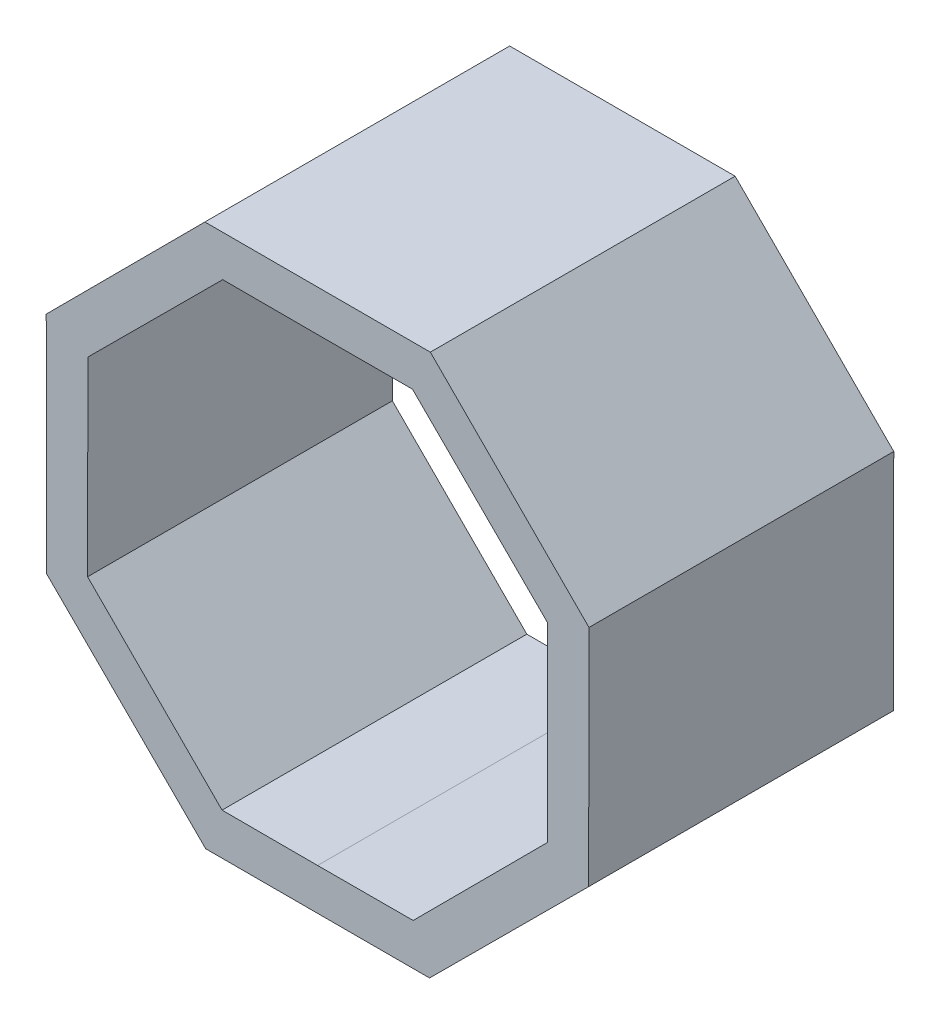
ISO-10303-21;
HEADER;
FILE_DESCRIPTION(('STEP AP214'),'2;1');
FILE_NAME('part.step','',(''),(''),'','','');
FILE_SCHEMA(('AUTOMOTIVE_DESIGN { 1 0 10303 214 1 1 1 1 }'));
ENDSEC;
DATA;
#1=APPLICATION_CONTEXT('core data for automotive mechanical design processes');
#2=APPLICATION_PROTOCOL_DEFINITION('international standard','automotive_design',2000,#1);
#3=PRODUCT_CONTEXT('',#1,'mechanical');
#4=PRODUCT('Part','Part','',(#3));
#5=PRODUCT_RELATED_PRODUCT_CATEGORY('part','',(#4));
#6=PRODUCT_DEFINITION_FORMATION('','',#4);
#7=PRODUCT_DEFINITION_CONTEXT('part definition',#1,'design');
#8=PRODUCT_DEFINITION('design','',#6,#7);
#9=PRODUCT_DEFINITION_SHAPE('','',#8);
#10=(LENGTH_UNIT() NAMED_UNIT(*) SI_UNIT(.MILLI.,.METRE.));
#11=(NAMED_UNIT(*) PLANE_ANGLE_UNIT() SI_UNIT($,.RADIAN.));
#12=(NAMED_UNIT(*) SI_UNIT($,.STERADIAN.) SOLID_ANGLE_UNIT());
#13=UNCERTAINTY_MEASURE_WITH_UNIT(LENGTH_MEASURE(1.E-05),#10,'distance_accuracy_value','');
#14=(GEOMETRIC_REPRESENTATION_CONTEXT(3) GLOBAL_UNCERTAINTY_ASSIGNED_CONTEXT((#13)) GLOBAL_UNIT_ASSIGNED_CONTEXT((#10,
#11,#12)) REPRESENTATION_CONTEXT('',''));
#15=CARTESIAN_POINT('',(0.,0.,0.));
#16=DIRECTION('',(0.,0.,1.));
#17=DIRECTION('',(1.,0.,0.));
#18=AXIS2_PLACEMENT_3D('',#15,#16,#17);
#19=CARTESIAN_POINT('',(-4.36451658606529,10.4936603456736,1.2));
#20=DIRECTION('',(-0.708135002050255,0.706077062983415,0.));
#21=DIRECTION('',(-0.706077062983415,-0.708135002050255,0.));
#22=AXIS2_PLACEMENT_3D('',#19,#20,#21);
#23=PLANE('',#22);
#24=DIRECTION('',(0.,0.,1.));
#25=VECTOR('',#24,1.);
#26=CARTESIAN_POINT('',(-4.36451658606529,10.4936603456736,1.2));
#27=LINE('',#26,#25);
#28=CARTESIAN_POINT('',(-4.36451658606529,10.4936603456736,-0.800000000000002));
#29=VERTEX_POINT('',#28);
#30=CARTESIAN_POINT('',(-4.36451658606529,10.4936603456736,11.));
#31=VERTEX_POINT('',#30);
#32=EDGE_CURVE('E11',#29,#31,#27,.T.);
#33=ORIENTED_EDGE('',*,*,#32,.F.);
#34=DIRECTION('',(-0.706077062983415,-0.708135002050255,0.));
#35=VECTOR('',#34,1.);
#36=CARTESIAN_POINT('',(-10.5063170194626,4.33395896106958,-0.800000000000002));
#37=LINE('',#36,#35);
#38=CARTESIAN_POINT('',(-10.5063170194626,4.33395896106958,-0.800000000000002));
#39=VERTEX_POINT('',#38);
#40=EDGE_CURVE('E201',#29,#39,#37,.T.);
#41=ORIENTED_EDGE('',*,*,#40,.T.);
#42=DIRECTION('',(0.,0.,1.));
#43=VECTOR('',#42,1.);
#44=CARTESIAN_POINT('',(-10.5063170194626,4.33395896106958,1.2));
#45=LINE('',#44,#43);
#46=CARTESIAN_POINT('',(-10.5063170194626,4.33395896106958,11.));
#47=VERTEX_POINT('',#46);
#48=EDGE_CURVE('E42',#39,#47,#45,.T.);
#49=ORIENTED_EDGE('',*,*,#48,.T.);
#50=DIRECTION('',(-0.706077062983415,-0.708135002050255,0.));
#51=VECTOR('',#50,1.);
#52=CARTESIAN_POINT('',(-4.36451658606529,10.4936603456736,11.));
#53=LINE('',#52,#51);
#54=EDGE_CURVE('E263',#31,#47,#53,.T.);
#55=ORIENTED_EDGE('',*,*,#54,.F.);
#56=EDGE_LOOP('',(#33,#41,#49,#55));
#57=FACE_BOUND('',#56,.T.);
#58=ADVANCED_FACE('F39',(#57),#23,.T.);
#59=CARTESIAN_POINT('',(-4.36451658606529,10.4936603456736,1.2));
#60=DIRECTION('',(0.,1.,0.));
#61=DIRECTION('',(0.,0.,1.));
#62=AXIS2_PLACEMENT_3D('',#59,#60,#61);
#63=PLANE('',#62);
#64=DIRECTION('',(0.,0.,1.));
#65=VECTOR('',#64,1.);
#66=CARTESIAN_POINT('',(4.36451658606529,10.4936603456736,1.2));
#67=LINE('',#66,#65);
#68=CARTESIAN_POINT('',(4.36451658606529,10.4936603456736,-0.800000000000002));
#69=VERTEX_POINT('',#68);
#70=CARTESIAN_POINT('',(4.36451658606529,10.4936603456736,11.));
#71=VERTEX_POINT('',#70);
#72=EDGE_CURVE('E47',#69,#71,#67,.T.);
#73=ORIENTED_EDGE('',*,*,#72,.F.);
#74=DIRECTION('',(-1.,0.,0.));
#75=VECTOR('',#74,1.);
#76=CARTESIAN_POINT('',(-4.36451658606529,10.4936603456736,-0.800000000000002));
#77=LINE('',#76,#75);
#78=EDGE_CURVE('E184',#69,#29,#77,.T.);
#79=ORIENTED_EDGE('',*,*,#78,.T.);
#80=ORIENTED_EDGE('',*,*,#32,.T.);
#81=DIRECTION('',(-1.,0.,0.));
#82=VECTOR('',#81,1.);
#83=CARTESIAN_POINT('',(-4.36451658606529,10.4936603456736,11.));
#84=LINE('',#83,#82);
#85=EDGE_CURVE('E298',#71,#31,#84,.T.);
#86=ORIENTED_EDGE('',*,*,#85,.F.);
#87=EDGE_LOOP('',(#73,#79,#80,#86));
#88=FACE_BOUND('',#87,.T.);
#89=ADVANCED_FACE('F315',(#88),#63,.T.);
#90=CARTESIAN_POINT('',(4.36451658606529,10.4936603456736,1.2));
#91=DIRECTION('',(0.708135002050255,0.706077062983415,0.));
#92=DIRECTION('',(-0.706077062983415,0.708135002050255,0.));
#93=AXIS2_PLACEMENT_3D('',#90,#91,#92);
#94=PLANE('',#93);
#95=DIRECTION('',(0.,0.,1.));
#96=VECTOR('',#95,1.);
#97=CARTESIAN_POINT('',(10.5063170194626,4.33395896106958,1.2));
#98=LINE('',#97,#96);
#99=CARTESIAN_POINT('',(10.5063170194626,4.33395896106958,-0.800000000000002));
#100=VERTEX_POINT('',#99);
#101=CARTESIAN_POINT('',(10.5063170194626,4.33395896106958,11.));
#102=VERTEX_POINT('',#101);
#103=EDGE_CURVE('E164',#100,#102,#98,.T.);
#104=ORIENTED_EDGE('',*,*,#103,.F.);
#105=DIRECTION('',(-0.706077062983415,0.708135002050255,0.));
#106=VECTOR('',#105,1.);
#107=CARTESIAN_POINT('',(4.36451658606529,10.4936603456736,-0.800000000000002));
#108=LINE('',#107,#106);
#109=EDGE_CURVE('E167',#100,#69,#108,.T.);
#110=ORIENTED_EDGE('',*,*,#109,.T.);
#111=ORIENTED_EDGE('',*,*,#72,.T.);
#112=DIRECTION('',(-0.706077062983415,0.708135002050255,0.));
#113=VECTOR('',#112,1.);
#114=CARTESIAN_POINT('',(4.36451658606529,10.4936603456736,11.));
#115=LINE('',#114,#113);
#116=EDGE_CURVE('E169',#102,#71,#115,.T.);
#117=ORIENTED_EDGE('',*,*,#116,.F.);
#118=EDGE_LOOP('',(#104,#110,#111,#117));
#119=FACE_BOUND('',#118,.T.);
#120=ADVANCED_FACE('F166',(#119),#94,.T.);
#121=CARTESIAN_POINT('',(10.4936603456736,-4.36451658606529,1.2));
#122=DIRECTION('',(0.999998941423632,-0.0014550435099099,0.));
#123=DIRECTION('',(0.0014550435099099,0.999998941423632,0.));
#124=AXIS2_PLACEMENT_3D('',#121,#122,#123);
#125=PLANE('',#124);
#126=DIRECTION('',(0.0014550435099099,0.999998941423632,0.));
#127=VECTOR('',#126,1.);
#128=CARTESIAN_POINT('',(10.4936603456736,-4.36451658606529,11.));
#129=LINE('',#128,#127);
#130=CARTESIAN_POINT('',(10.4936603456736,-4.36451658606529,11.));
#131=VERTEX_POINT('',#130);
#132=EDGE_CURVE('E295',#131,#102,#129,.T.);
#133=ORIENTED_EDGE('',*,*,#132,.F.);
#134=DIRECTION('',(0.,0.,1.));
#135=VECTOR('',#134,1.);
#136=CARTESIAN_POINT('',(10.4936603456736,-4.36451658606529,1.2));
#137=LINE('',#136,#135);
#138=CARTESIAN_POINT('',(10.4936603456736,-4.36451658606529,-0.800000000000002));
#139=VERTEX_POINT('',#138);
#140=EDGE_CURVE('E174',#139,#131,#137,.T.);
#141=ORIENTED_EDGE('',*,*,#140,.F.);
#142=DIRECTION('',(0.0014550435099099,0.999998941423632,0.));
#143=VECTOR('',#142,1.);
#144=CARTESIAN_POINT('',(10.5063170194626,4.33395896106958,-0.800000000000002));
#145=LINE('',#144,#143);
#146=EDGE_CURVE('E181',#139,#100,#145,.T.);
#147=ORIENTED_EDGE('',*,*,#146,.T.);
#148=ORIENTED_EDGE('',*,*,#103,.T.);
#149=EDGE_LOOP('',(#133,#141,#147,#148));
#150=FACE_BOUND('',#149,.T.);
#151=ADVANCED_FACE('F186',(#150),#125,.T.);
#152=CARTESIAN_POINT('',(4.33395896106958,-10.5063170194626,1.2));
#153=DIRECTION('',(0.706077062983415,-0.708135002050255,0.));
#154=DIRECTION('',(0.708135002050255,0.706077062983415,0.));
#155=AXIS2_PLACEMENT_3D('',#152,#153,#154);
#156=PLANE('',#155);
#157=DIRECTION('',(0.,0.,1.));
#158=VECTOR('',#157,1.);
#159=CARTESIAN_POINT('',(4.33395896106958,-10.5063170194626,1.2));
#160=LINE('',#159,#158);
#161=CARTESIAN_POINT('',(4.33395896106958,-10.5063170194626,-0.800000000000002));
#162=VERTEX_POINT('',#161);
#163=CARTESIAN_POINT('',(4.33395896106958,-10.5063170194626,11.));
#164=VERTEX_POINT('',#163);
#165=EDGE_CURVE('E303',#162,#164,#160,.T.);
#166=ORIENTED_EDGE('',*,*,#165,.F.);
#167=DIRECTION('',(0.708135002050255,0.706077062983415,0.));
#168=VECTOR('',#167,1.);
#169=CARTESIAN_POINT('',(10.4936603456736,-4.36451658606529,-0.800000000000002));
#170=LINE('',#169,#168);
#171=EDGE_CURVE('E187',#162,#139,#170,.T.);
#172=ORIENTED_EDGE('',*,*,#171,.T.);
#173=ORIENTED_EDGE('',*,*,#140,.T.);
#174=DIRECTION('',(0.708135002050255,0.706077062983415,0.));
#175=VECTOR('',#174,1.);
#176=CARTESIAN_POINT('',(4.33395896106958,-10.5063170194626,11.));
#177=LINE('',#176,#175);
#178=EDGE_CURVE('E292',#164,#131,#177,.T.);
#179=ORIENTED_EDGE('',*,*,#178,.F.);
#180=EDGE_LOOP('',(#166,#172,#173,#179));
#181=FACE_BOUND('',#180,.T.);
#182=ADVANCED_FACE('F380',(#181),#156,.T.);
#183=CARTESIAN_POINT('',(-4.33395896106958,-10.5063170194626,1.2));
#184=DIRECTION('',(0.,-1.,0.));
#185=DIRECTION('',(0.,0.,-1.));
#186=AXIS2_PLACEMENT_3D('',#183,#184,#185);
#187=PLANE('',#186);
#188=DIRECTION('',(0.,0.,1.));
#189=VECTOR('',#188,1.);
#190=CARTESIAN_POINT('',(-4.33395896106958,-10.5063170194626,1.2));
#191=LINE('',#190,#189);
#192=CARTESIAN_POINT('',(-4.33395896106958,-10.5063170194626,-0.800000000000002));
#193=VERTEX_POINT('',#192);
#194=CARTESIAN_POINT('',(-4.33395896106958,-10.5063170194626,11.));
#195=VERTEX_POINT('',#194);
#196=EDGE_CURVE('E305',#193,#195,#191,.T.);
#197=ORIENTED_EDGE('',*,*,#196,.F.);
#198=DIRECTION('',(1.,0.,0.));
#199=VECTOR('',#198,1.);
#200=CARTESIAN_POINT('',(4.33395896106958,-10.5063170194626,-0.800000000000002));
#201=LINE('',#200,#199);
#202=EDGE_CURVE('E189',#193,#162,#201,.T.);
#203=ORIENTED_EDGE('',*,*,#202,.T.);
#204=ORIENTED_EDGE('',*,*,#165,.T.);
#205=DIRECTION('',(1.,0.,0.));
#206=VECTOR('',#205,1.);
#207=CARTESIAN_POINT('',(-4.33395896106958,-10.5063170194626,11.));
#208=LINE('',#207,#206);
#209=EDGE_CURVE('E289',#195,#164,#208,.T.);
#210=ORIENTED_EDGE('',*,*,#209,.F.);
#211=EDGE_LOOP('',(#197,#203,#204,#210));
#212=FACE_BOUND('',#211,.T.);
#213=ADVANCED_FACE('F383',(#212),#187,.T.);
#214=CARTESIAN_POINT('',(-4.33395896106958,-10.5063170194626,1.2));
#215=DIRECTION('',(-0.706077062983415,-0.708135002050255,0.));
#216=DIRECTION('',(0.708135002050255,-0.706077062983415,0.));
#217=AXIS2_PLACEMENT_3D('',#214,#215,#216);
#218=PLANE('',#217);
#219=DIRECTION('',(0.,0.,1.));
#220=VECTOR('',#219,1.);
#221=CARTESIAN_POINT('',(-10.4936603456736,-4.36451658606529,1.2));
#222=LINE('',#221,#220);
#223=CARTESIAN_POINT('',(-10.4936603456736,-4.36451658606529,-0.800000000000002));
#224=VERTEX_POINT('',#223);
#225=CARTESIAN_POINT('',(-10.4936603456736,-4.36451658606529,11.));
#226=VERTEX_POINT('',#225);
#227=EDGE_CURVE('E306',#224,#226,#222,.T.);
#228=ORIENTED_EDGE('',*,*,#227,.F.);
#229=DIRECTION('',(0.708135002050255,-0.706077062983415,0.));
#230=VECTOR('',#229,1.);
#231=CARTESIAN_POINT('',(-4.33395896106958,-10.5063170194626,-0.800000000000002));
#232=LINE('',#231,#230);
#233=EDGE_CURVE('E195',#224,#193,#232,.T.);
#234=ORIENTED_EDGE('',*,*,#233,.T.);
#235=ORIENTED_EDGE('',*,*,#196,.T.);
#236=DIRECTION('',(0.708135002050255,-0.706077062983415,0.));
#237=VECTOR('',#236,1.);
#238=CARTESIAN_POINT('',(-4.33395896106958,-10.5063170194626,11.));
#239=LINE('',#238,#237);
#240=EDGE_CURVE('E286',#226,#195,#239,.T.);
#241=ORIENTED_EDGE('',*,*,#240,.F.);
#242=EDGE_LOOP('',(#228,#234,#235,#241));
#243=FACE_BOUND('',#242,.T.);
#244=ADVANCED_FACE('F387',(#243),#218,.T.);
#245=CARTESIAN_POINT('',(-10.4936603456736,-4.36451658606529,1.2));
#246=DIRECTION('',(-0.999998941423632,-0.0014550435099099,0.));
#247=DIRECTION('',(0.0014550435099099,-0.999998941423632,0.));
#248=AXIS2_PLACEMENT_3D('',#245,#246,#247);
#249=PLANE('',#248);
#250=DIRECTION('',(0.0014550435099099,-0.999998941423632,0.));
#251=VECTOR('',#250,1.);
#252=CARTESIAN_POINT('',(-10.4936603456736,-4.36451658606529,11.));
#253=LINE('',#252,#251);
#254=EDGE_CURVE('E283',#47,#226,#253,.T.);
#255=ORIENTED_EDGE('',*,*,#254,.F.);
#256=ORIENTED_EDGE('',*,*,#48,.F.);
#257=DIRECTION('',(0.0014550435099099,-0.999998941423632,0.));
#258=VECTOR('',#257,1.);
#259=CARTESIAN_POINT('',(-10.4936603456736,-4.36451658606529,-0.800000000000002));
#260=LINE('',#259,#258);
#261=EDGE_CURVE('E198',#39,#224,#260,.T.);
#262=ORIENTED_EDGE('',*,*,#261,.T.);
#263=ORIENTED_EDGE('',*,*,#227,.T.);
#264=EDGE_LOOP('',(#255,#256,#262,#263));
#265=FACE_BOUND('',#264,.T.);
#266=ADVANCED_FACE('F312',(#265),#249,.T.);
#267=CARTESIAN_POINT('',(0.,0.,11.));
#268=DIRECTION('',(0.,0.,-1.));
#269=DIRECTION('',(-1.,0.,0.));
#270=AXIS2_PLACEMENT_3D('',#267,#268,#269);
#271=PLANE('',#270);
#272=DIRECTION('',(-0.0014550254285904,-0.999998941449941,0.));
#273=VECTOR('',#272,1.);
#274=CARTESIAN_POINT('',(-8.89462698251009,3.6994474940002,11.));
#275=LINE('',#274,#273);
#276=CARTESIAN_POINT('',(-8.89462698251009,3.6994474940002,11.));
#277=VERTEX_POINT('',#276);
#278=CARTESIAN_POINT('',(-8.90535488724709,-3.67354624904692,11.));
#279=VERTEX_POINT('',#278);
#280=EDGE_CURVE('E233',#277,#279,#275,.T.);
#281=ORIENTED_EDGE('',*,*,#280,.F.);
#282=DIRECTION('',(-0.708135012325157,-0.706077052678565,0.));
#283=VECTOR('',#282,1.);
#284=CARTESIAN_POINT('',(-3.67354624904692,8.90535488724709,11.));
#285=LINE('',#284,#283);
#286=CARTESIAN_POINT('',(-3.67354624904692,8.90535488724709,11.));
#287=VERTEX_POINT('',#286);
#288=EDGE_CURVE('E55',#287,#277,#285,.T.);
#289=ORIENTED_EDGE('',*,*,#288,.F.);
#290=DIRECTION('',(-0.999998941449941,0.00145502542859038,0.));
#291=VECTOR('',#290,1.);
#292=CARTESIAN_POINT('',(0.,8.90000977838355,11.));
#293=LINE('',#292,#291);
#294=CARTESIAN_POINT('',(0.,8.90000977838355,11.));
#295=VERTEX_POINT('',#294);
#296=EDGE_CURVE('E257',#295,#287,#293,.T.);
#297=ORIENTED_EDGE('',*,*,#296,.F.);
#298=DIRECTION('',(-0.999998941449941,-0.00145502542859038,0.));
#299=VECTOR('',#298,1.);
#300=CARTESIAN_POINT('',(0.,8.90000977838355,11.));
#301=LINE('',#300,#299);
#302=CARTESIAN_POINT('',(3.67354624904692,8.90535488724709,11.));
#303=VERTEX_POINT('',#302);
#304=EDGE_CURVE('E254',#303,#295,#301,.T.);
#305=ORIENTED_EDGE('',*,*,#304,.F.);
#306=DIRECTION('',(-0.708135012325157,0.706077052678565,0.));
#307=VECTOR('',#306,1.);
#308=CARTESIAN_POINT('',(3.67354624904692,8.90535488724709,11.));
#309=LINE('',#308,#307);
#310=CARTESIAN_POINT('',(8.89462698251009,3.6994474940002,11.));
#311=VERTEX_POINT('',#310);
#312=EDGE_CURVE('E251',#311,#303,#309,.T.);
#313=ORIENTED_EDGE('',*,*,#312,.F.);
#314=DIRECTION('',(-0.0014550254285904,0.999998941449941,0.));
#315=VECTOR('',#314,1.);
#316=CARTESIAN_POINT('',(8.89462698251009,3.6994474940002,11.));
#317=LINE('',#316,#315);
#318=CARTESIAN_POINT('',(8.90535488724709,-3.67354624904692,11.));
#319=VERTEX_POINT('',#318);
#320=EDGE_CURVE('E248',#319,#311,#317,.T.);
#321=ORIENTED_EDGE('',*,*,#320,.F.);
#322=DIRECTION('',(0.706077052678565,0.708135012325157,0.));
#323=VECTOR('',#322,1.);
#324=CARTESIAN_POINT('',(8.90535488724709,-3.67354624904692,11.));
#325=LINE('',#324,#323);
#326=CARTESIAN_POINT('',(3.6994474940002,-8.89462698251009,11.));
#327=VERTEX_POINT('',#326);
#328=EDGE_CURVE('E245',#327,#319,#325,.T.);
#329=ORIENTED_EDGE('',*,*,#328,.F.);
#330=DIRECTION('',(0.999998941449941,0.00145502542859043,0.));
#331=VECTOR('',#330,1.);
#332=CARTESIAN_POINT('',(3.6994474940002,-8.89462698251009,11.));
#333=LINE('',#332,#331);
#334=CARTESIAN_POINT('',(0.,-8.90000977838355,11.));
#335=VERTEX_POINT('',#334);
#336=EDGE_CURVE('E242',#335,#327,#333,.T.);
#337=ORIENTED_EDGE('',*,*,#336,.F.);
#338=DIRECTION('',(0.999998941449941,-0.00145502542859043,0.));
#339=VECTOR('',#338,1.);
#340=CARTESIAN_POINT('',(-3.6994474940002,-8.89462698251009,11.));
#341=LINE('',#340,#339);
#342=CARTESIAN_POINT('',(-3.6994474940002,-8.89462698251009,11.));
#343=VERTEX_POINT('',#342);
#344=EDGE_CURVE('E239',#343,#335,#341,.T.);
#345=ORIENTED_EDGE('',*,*,#344,.F.);
#346=DIRECTION('',(0.706077052678565,-0.708135012325157,0.));
#347=VECTOR('',#346,1.);
#348=CARTESIAN_POINT('',(-8.90535488724709,-3.67354624904692,11.));
#349=LINE('',#348,#347);
#350=EDGE_CURVE('E236',#279,#343,#349,.T.);
#351=ORIENTED_EDGE('',*,*,#350,.F.);
#352=EDGE_LOOP('',(#281,#289,#297,#305,#313,#321,#329,#337,#345,#351));
#353=FACE_BOUND('',#352,.T.);
#354=ORIENTED_EDGE('',*,*,#54,.T.);
#355=ORIENTED_EDGE('',*,*,#254,.T.);
#356=ORIENTED_EDGE('',*,*,#240,.T.);
#357=ORIENTED_EDGE('',*,*,#209,.T.);
#358=ORIENTED_EDGE('',*,*,#178,.T.);
#359=ORIENTED_EDGE('',*,*,#132,.T.);
#360=ORIENTED_EDGE('',*,*,#116,.T.);
#361=ORIENTED_EDGE('',*,*,#85,.T.);
#362=EDGE_LOOP('',(#354,#355,#356,#357,#358,#359,#360,#361));
#363=FACE_BOUND('',#362,.T.);
#364=ADVANCED_FACE('F314',(#353,#363),#271,.F.);
#365=CARTESIAN_POINT('',(-3.67354624904692,8.90535488724709,1.2));
#366=DIRECTION('',(-0.706077052678565,0.708135012325158,0.));
#367=DIRECTION('',(-0.708135012325158,-0.706077052678565,0.));
#368=AXIS2_PLACEMENT_3D('',#365,#366,#367);
#369=PLANE('',#368);
#370=ORIENTED_EDGE('',*,*,#288,.T.);
#371=DIRECTION('',(0.,0.,1.));
#372=VECTOR('',#371,1.);
#373=CARTESIAN_POINT('',(-8.89462698251009,3.6994474940002,1.2));
#374=LINE('',#373,#372);
#375=CARTESIAN_POINT('',(-8.89462698251009,3.6994474940002,-0.800000000000002));
#376=VERTEX_POINT('',#375);
#377=EDGE_CURVE('E260',#376,#277,#374,.T.);
#378=ORIENTED_EDGE('',*,*,#377,.F.);
#379=DIRECTION('',(-0.708135012325157,-0.706077052678565,0.));
#380=VECTOR('',#379,1.);
#381=CARTESIAN_POINT('',(-8.89462698251009,3.6994474940002,-0.800000000000002));
#382=LINE('',#381,#380);
#383=CARTESIAN_POINT('',(-3.67354624904692,8.90535488724709,-0.800000000000002));
#384=VERTEX_POINT('',#383);
#385=EDGE_CURVE('E211',#384,#376,#382,.T.);
#386=ORIENTED_EDGE('',*,*,#385,.F.);
#387=DIRECTION('',(0.,0.,1.));
#388=VECTOR('',#387,1.);
#389=CARTESIAN_POINT('',(-3.67354624904692,8.90535488724709,1.2));
#390=LINE('',#389,#388);
#391=EDGE_CURVE('E261',#384,#287,#390,.T.);
#392=ORIENTED_EDGE('',*,*,#391,.T.);
#393=EDGE_LOOP('',(#370,#378,#386,#392));
#394=FACE_BOUND('',#393,.T.);
#395=ADVANCED_FACE('F348',(#394),#369,.F.);
#396=CARTESIAN_POINT('',(0.,8.90000977838355,1.2));
#397=DIRECTION('',(0.00145502542859038,0.999998941449941,0.));
#398=DIRECTION('',(-0.999998941449941,0.00145502542859038,0.));
#399=AXIS2_PLACEMENT_3D('',#396,#397,#398);
#400=PLANE('',#399);
#401=ORIENTED_EDGE('',*,*,#296,.T.);
#402=ORIENTED_EDGE('',*,*,#391,.F.);
#403=DIRECTION('',(-0.999998941449941,0.00145502542859038,0.));
#404=VECTOR('',#403,1.);
#405=CARTESIAN_POINT('',(-3.67354624904692,8.90535488724709,-0.800000000000002));
#406=LINE('',#405,#404);
#407=CARTESIAN_POINT('',(0.,8.90000977838355,-0.800000000000002));
#408=VERTEX_POINT('',#407);
#409=EDGE_CURVE('E214',#408,#384,#406,.T.);
#410=ORIENTED_EDGE('',*,*,#409,.F.);
#411=DIRECTION('',(0.,0.,1.));
#412=VECTOR('',#411,1.);
#413=CARTESIAN_POINT('',(0.,8.90000977838355,1.2));
#414=LINE('',#413,#412);
#415=EDGE_CURVE('E264',#408,#295,#414,.T.);
#416=ORIENTED_EDGE('',*,*,#415,.T.);
#417=EDGE_LOOP('',(#401,#402,#410,#416));
#418=FACE_BOUND('',#417,.T.);
#419=ADVANCED_FACE('F345',(#418),#400,.F.);
#420=CARTESIAN_POINT('',(0.,8.90000977838355,1.2));
#421=DIRECTION('',(-0.00145502542859038,0.999998941449941,0.));
#422=DIRECTION('',(-0.999998941449941,-0.00145502542859038,0.));
#423=AXIS2_PLACEMENT_3D('',#420,#421,#422);
#424=PLANE('',#423);
#425=ORIENTED_EDGE('',*,*,#304,.T.);
#426=ORIENTED_EDGE('',*,*,#415,.F.);
#427=DIRECTION('',(-0.999998941449941,-0.00145502542859038,0.));
#428=VECTOR('',#427,1.);
#429=CARTESIAN_POINT('',(0.,8.90000977838355,-0.800000000000002));
#430=LINE('',#429,#428);
#431=CARTESIAN_POINT('',(3.67354624904692,8.90535488724709,-0.800000000000002));
#432=VERTEX_POINT('',#431);
#433=EDGE_CURVE('E217',#432,#408,#430,.T.);
#434=ORIENTED_EDGE('',*,*,#433,.F.);
#435=DIRECTION('',(0.,0.,1.));
#436=VECTOR('',#435,1.);
#437=CARTESIAN_POINT('',(3.67354624904692,8.90535488724709,1.2));
#438=LINE('',#437,#436);
#439=EDGE_CURVE('E266',#432,#303,#438,.T.);
#440=ORIENTED_EDGE('',*,*,#439,.T.);
#441=EDGE_LOOP('',(#425,#426,#434,#440));
#442=FACE_BOUND('',#441,.T.);
#443=ADVANCED_FACE('F342',(#442),#424,.F.);
#444=CARTESIAN_POINT('',(3.67354624904692,8.90535488724709,1.2));
#445=DIRECTION('',(0.706077052678565,0.708135012325158,0.));
#446=DIRECTION('',(-0.708135012325158,0.706077052678565,0.));
#447=AXIS2_PLACEMENT_3D('',#444,#445,#446);
#448=PLANE('',#447);
#449=ORIENTED_EDGE('',*,*,#312,.T.);
#450=ORIENTED_EDGE('',*,*,#439,.F.);
#451=DIRECTION('',(-0.708135012325157,0.706077052678565,0.));
#452=VECTOR('',#451,1.);
#453=CARTESIAN_POINT('',(3.67354624904692,8.90535488724709,-0.800000000000002));
#454=LINE('',#453,#452);
#455=CARTESIAN_POINT('',(8.89462698251009,3.6994474940002,-0.800000000000002));
#456=VERTEX_POINT('',#455);
#457=EDGE_CURVE('E220',#456,#432,#454,.T.);
#458=ORIENTED_EDGE('',*,*,#457,.F.);
#459=DIRECTION('',(0.,0.,1.));
#460=VECTOR('',#459,1.);
#461=CARTESIAN_POINT('',(8.89462698251009,3.6994474940002,1.2));
#462=LINE('',#461,#460);
#463=EDGE_CURVE('E268',#456,#311,#462,.T.);
#464=ORIENTED_EDGE('',*,*,#463,.T.);
#465=EDGE_LOOP('',(#449,#450,#458,#464));
#466=FACE_BOUND('',#465,.T.);
#467=ADVANCED_FACE('F337',(#466),#448,.F.);
#468=CARTESIAN_POINT('',(8.89462698251009,3.6994474940002,1.2));
#469=DIRECTION('',(0.999998941449941,0.0014550254285904,0.));
#470=DIRECTION('',(-0.0014550254285904,0.999998941449941,0.));
#471=AXIS2_PLACEMENT_3D('',#468,#469,#470);
#472=PLANE('',#471);
#473=ORIENTED_EDGE('',*,*,#320,.T.);
#474=ORIENTED_EDGE('',*,*,#463,.F.);
#475=DIRECTION('',(-0.0014550254285904,0.999998941449941,0.));
#476=VECTOR('',#475,1.);
#477=CARTESIAN_POINT('',(8.89462698251009,3.6994474940002,-0.800000000000002));
#478=LINE('',#477,#476);
#479=CARTESIAN_POINT('',(8.90535488724709,-3.67354624904692,-0.800000000000002));
#480=VERTEX_POINT('',#479);
#481=EDGE_CURVE('E223',#480,#456,#478,.T.);
#482=ORIENTED_EDGE('',*,*,#481,.F.);
#483=DIRECTION('',(0.,0.,1.));
#484=VECTOR('',#483,1.);
#485=CARTESIAN_POINT('',(8.90535488724709,-3.67354624904692,1.2));
#486=LINE('',#485,#484);
#487=EDGE_CURVE('E270',#480,#319,#486,.T.);
#488=ORIENTED_EDGE('',*,*,#487,.T.);
#489=EDGE_LOOP('',(#473,#474,#482,#488));
#490=FACE_BOUND('',#489,.T.);
#491=ADVANCED_FACE('F334',(#490),#472,.F.);
#492=CARTESIAN_POINT('',(8.90535488724709,-3.67354624904692,1.2));
#493=DIRECTION('',(0.708135012325158,-0.706077052678565,0.));
#494=DIRECTION('',(0.706077052678565,0.708135012325158,0.));
#495=AXIS2_PLACEMENT_3D('',#492,#493,#494);
#496=PLANE('',#495);
#497=ORIENTED_EDGE('',*,*,#328,.T.);
#498=ORIENTED_EDGE('',*,*,#487,.F.);
#499=DIRECTION('',(0.706077052678565,0.708135012325157,0.));
#500=VECTOR('',#499,1.);
#501=CARTESIAN_POINT('',(8.90535488724709,-3.67354624904692,-0.800000000000002));
#502=LINE('',#501,#500);
#503=CARTESIAN_POINT('',(3.6994474940002,-8.89462698251009,-0.800000000000002));
#504=VERTEX_POINT('',#503);
#505=EDGE_CURVE('E226',#504,#480,#502,.T.);
#506=ORIENTED_EDGE('',*,*,#505,.F.);
#507=DIRECTION('',(0.,0.,1.));
#508=VECTOR('',#507,1.);
#509=CARTESIAN_POINT('',(3.6994474940002,-8.89462698251009,1.2));
#510=LINE('',#509,#508);
#511=EDGE_CURVE('E272',#504,#327,#510,.T.);
#512=ORIENTED_EDGE('',*,*,#511,.T.);
#513=EDGE_LOOP('',(#497,#498,#506,#512));
#514=FACE_BOUND('',#513,.T.);
#515=ADVANCED_FACE('F329',(#514),#496,.F.);
#516=CARTESIAN_POINT('',(3.6994474940002,-8.89462698251009,1.2));
#517=DIRECTION('',(0.00145502542859043,-0.999998941449941,0.));
#518=DIRECTION('',(0.999998941449941,0.00145502542859043,0.));
#519=AXIS2_PLACEMENT_3D('',#516,#517,#518);
#520=PLANE('',#519);
#521=ORIENTED_EDGE('',*,*,#336,.T.);
#522=ORIENTED_EDGE('',*,*,#511,.F.);
#523=DIRECTION('',(0.999998941449941,0.00145502542859043,0.));
#524=VECTOR('',#523,1.);
#525=CARTESIAN_POINT('',(3.6994474940002,-8.89462698251009,-0.800000000000002));
#526=LINE('',#525,#524);
#527=CARTESIAN_POINT('',(0.,-8.90000977838355,-0.800000000000002));
#528=VERTEX_POINT('',#527);
#529=EDGE_CURVE('E229',#528,#504,#526,.T.);
#530=ORIENTED_EDGE('',*,*,#529,.F.);
#531=DIRECTION('',(0.,0.,1.));
#532=VECTOR('',#531,1.);
#533=CARTESIAN_POINT('',(0.,-8.90000977838355,1.2));
#534=LINE('',#533,#532);
#535=EDGE_CURVE('E274',#528,#335,#534,.T.);
#536=ORIENTED_EDGE('',*,*,#535,.T.);
#537=EDGE_LOOP('',(#521,#522,#530,#536));
#538=FACE_BOUND('',#537,.T.);
#539=ADVANCED_FACE('F325',(#538),#520,.F.);
#540=CARTESIAN_POINT('',(-3.6994474940002,-8.89462698251009,1.2));
#541=DIRECTION('',(-0.00145502542859043,-0.999998941449941,0.));
#542=DIRECTION('',(0.999998941449941,-0.00145502542859043,0.));
#543=AXIS2_PLACEMENT_3D('',#540,#541,#542);
#544=PLANE('',#543);
#545=ORIENTED_EDGE('',*,*,#344,.T.);
#546=ORIENTED_EDGE('',*,*,#535,.F.);
#547=DIRECTION('',(0.999998941449941,-0.00145502542859043,0.));
#548=VECTOR('',#547,1.);
#549=CARTESIAN_POINT('',(0.,-8.90000977838355,-0.800000000000002));
#550=LINE('',#549,#548);
#551=CARTESIAN_POINT('',(-3.6994474940002,-8.89462698251009,-0.800000000000002));
#552=VERTEX_POINT('',#551);
#553=EDGE_CURVE('E207',#552,#528,#550,.T.);
#554=ORIENTED_EDGE('',*,*,#553,.F.);
#555=DIRECTION('',(0.,0.,1.));
#556=VECTOR('',#555,1.);
#557=CARTESIAN_POINT('',(-3.6994474940002,-8.89462698251009,1.2));
#558=LINE('',#557,#556);
#559=EDGE_CURVE('E276',#552,#343,#558,.T.);
#560=ORIENTED_EDGE('',*,*,#559,.T.);
#561=EDGE_LOOP('',(#545,#546,#554,#560));
#562=FACE_BOUND('',#561,.T.);
#563=ADVANCED_FACE('F357',(#562),#544,.F.);
#564=CARTESIAN_POINT('',(-8.90535488724709,-3.67354624904692,1.2));
#565=DIRECTION('',(-0.708135012325158,-0.706077052678565,0.));
#566=DIRECTION('',(0.706077052678565,-0.708135012325158,0.));
#567=AXIS2_PLACEMENT_3D('',#564,#565,#566);
#568=PLANE('',#567);
#569=ORIENTED_EDGE('',*,*,#350,.T.);
#570=ORIENTED_EDGE('',*,*,#559,.F.);
#571=DIRECTION('',(0.706077052678565,-0.708135012325158,0.));
#572=VECTOR('',#571,1.);
#573=CARTESIAN_POINT('',(-3.6994474940002,-8.89462698251009,-0.800000000000002));
#574=LINE('',#573,#572);
#575=CARTESIAN_POINT('',(-8.90535488724709,-3.67354624904692,-0.800000000000002));
#576=VERTEX_POINT('',#575);
#577=EDGE_CURVE('E204',#576,#552,#574,.T.);
#578=ORIENTED_EDGE('',*,*,#577,.F.);
#579=DIRECTION('',(0.,0.,1.));
#580=VECTOR('',#579,1.);
#581=CARTESIAN_POINT('',(-8.90535488724709,-3.67354624904692,1.2));
#582=LINE('',#581,#580);
#583=EDGE_CURVE('E278',#576,#279,#582,.T.);
#584=ORIENTED_EDGE('',*,*,#583,.T.);
#585=EDGE_LOOP('',(#569,#570,#578,#584));
#586=FACE_BOUND('',#585,.T.);
#587=ADVANCED_FACE('F356',(#586),#568,.F.);
#588=CARTESIAN_POINT('',(-8.89462698251009,3.6994474940002,1.2));
#589=DIRECTION('',(-0.999998941449941,0.0014550254285904,0.));
#590=DIRECTION('',(-0.0014550254285904,-0.999998941449941,0.));
#591=AXIS2_PLACEMENT_3D('',#588,#589,#590);
#592=PLANE('',#591);
#593=ORIENTED_EDGE('',*,*,#280,.T.);
#594=ORIENTED_EDGE('',*,*,#583,.F.);
#595=DIRECTION('',(-0.0014550254285904,-0.999998941449941,0.));
#596=VECTOR('',#595,1.);
#597=CARTESIAN_POINT('',(-8.90535488724709,-3.67354624904692,-0.800000000000002));
#598=LINE('',#597,#596);
#599=EDGE_CURVE('E208',#376,#576,#598,.T.);
#600=ORIENTED_EDGE('',*,*,#599,.F.);
#601=ORIENTED_EDGE('',*,*,#377,.T.);
#602=EDGE_LOOP('',(#593,#594,#600,#601));
#603=FACE_BOUND('',#602,.T.);
#604=ADVANCED_FACE('F351',(#603),#592,.F.);
#605=CARTESIAN_POINT('',(-0.0325141903268896,0.0114537509530808,-0.800000000000004));
#606=DIRECTION('',(0.,0.,1.));
#607=DIRECTION('',(1.,0.,0.));
#608=AXIS2_PLACEMENT_3D('',#605,#606,#607);
#609=PLANE('',#608);
#610=ORIENTED_EDGE('',*,*,#577,.T.);
#611=ORIENTED_EDGE('',*,*,#553,.T.);
#612=ORIENTED_EDGE('',*,*,#529,.T.);
#613=ORIENTED_EDGE('',*,*,#505,.T.);
#614=ORIENTED_EDGE('',*,*,#481,.T.);
#615=ORIENTED_EDGE('',*,*,#457,.T.);
#616=ORIENTED_EDGE('',*,*,#433,.T.);
#617=ORIENTED_EDGE('',*,*,#409,.T.);
#618=ORIENTED_EDGE('',*,*,#385,.T.);
#619=ORIENTED_EDGE('',*,*,#599,.T.);
#620=EDGE_LOOP('',(#610,#611,#612,#613,#614,#615,#616,#617,#618,#619));
#621=FACE_BOUND('',#620,.T.);
#622=ORIENTED_EDGE('',*,*,#109,.F.);
#623=ORIENTED_EDGE('',*,*,#146,.F.);
#624=ORIENTED_EDGE('',*,*,#171,.F.);
#625=ORIENTED_EDGE('',*,*,#202,.F.);
#626=ORIENTED_EDGE('',*,*,#233,.F.);
#627=ORIENTED_EDGE('',*,*,#261,.F.);
#628=ORIENTED_EDGE('',*,*,#40,.F.);
#629=ORIENTED_EDGE('',*,*,#78,.F.);
#630=EDGE_LOOP('',(#622,#623,#624,#625,#626,#627,#628,#629));
#631=FACE_BOUND('',#630,.T.);
#632=ADVANCED_FACE('F179',(#621,#631),#609,.F.);
#633=CLOSED_SHELL('',(#58,#89,#120,#151,#182,#213,#244,#266,#364,#395,#419,#443,#467,#491,#515,
#539,#563,#587,#604,#632));
#634=MANIFOLD_SOLID_BREP('B2',#633);
#635=ADVANCED_BREP_SHAPE_REPRESENTATION('',(#18,#634),#14);
#636=SHAPE_DEFINITION_REPRESENTATION(#9,#635);
ENDSEC;
END-ISO-10303-21;
